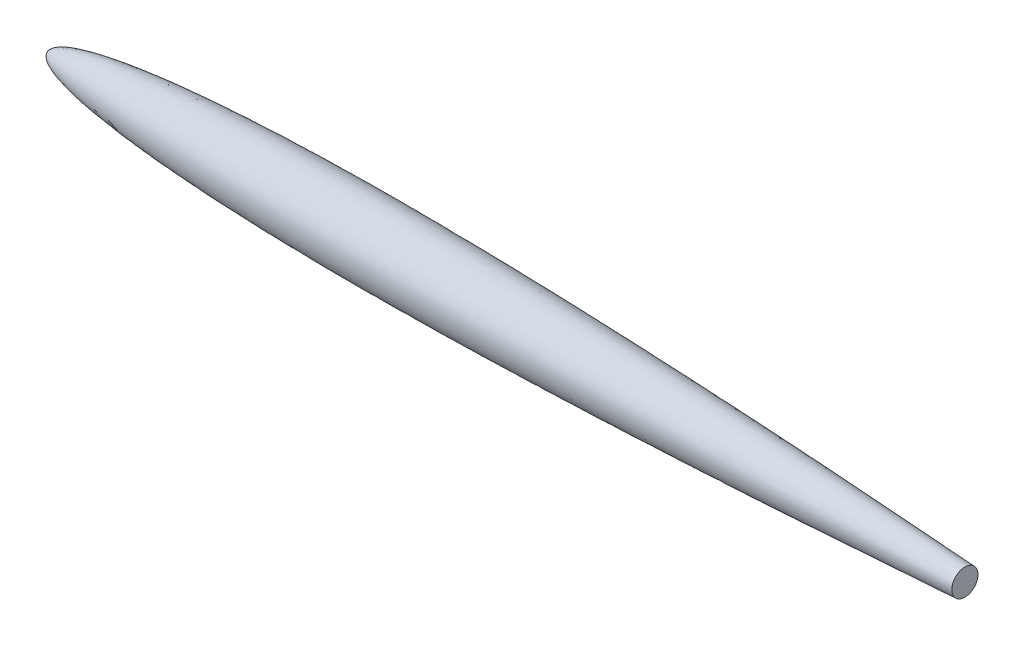
ISO-10303-21;
HEADER;
FILE_DESCRIPTION(('STEP AP214'),'2;1');
FILE_NAME('part.step','',(''),(''),'','','');
FILE_SCHEMA(('AUTOMOTIVE_DESIGN { 1 0 10303 214 1 1 1 1 }'));
ENDSEC;
DATA;
#1=APPLICATION_CONTEXT('core data for automotive mechanical design processes');
#2=APPLICATION_PROTOCOL_DEFINITION('international standard','automotive_design',2000,#1);
#3=PRODUCT_CONTEXT('',#1,'mechanical');
#4=PRODUCT('Part','Part','',(#3));
#5=PRODUCT_RELATED_PRODUCT_CATEGORY('part','',(#4));
#6=PRODUCT_DEFINITION_FORMATION('','',#4);
#7=PRODUCT_DEFINITION_CONTEXT('part definition',#1,'design');
#8=PRODUCT_DEFINITION('design','',#6,#7);
#9=PRODUCT_DEFINITION_SHAPE('','',#8);
#10=(LENGTH_UNIT() NAMED_UNIT(*) SI_UNIT(.MILLI.,.METRE.));
#11=(NAMED_UNIT(*) PLANE_ANGLE_UNIT() SI_UNIT($,.RADIAN.));
#12=(NAMED_UNIT(*) SI_UNIT($,.STERADIAN.) SOLID_ANGLE_UNIT());
#13=UNCERTAINTY_MEASURE_WITH_UNIT(LENGTH_MEASURE(1.E-05),#10,'distance_accuracy_value','');
#14=(GEOMETRIC_REPRESENTATION_CONTEXT(3) GLOBAL_UNCERTAINTY_ASSIGNED_CONTEXT((#13)) GLOBAL_UNIT_ASSIGNED_CONTEXT((#10,
#11,#12)) REPRESENTATION_CONTEXT('',''));
#15=CARTESIAN_POINT('',(0.,0.,0.));
#16=DIRECTION('',(0.,0.,1.));
#17=DIRECTION('',(1.,0.,0.));
#18=AXIS2_PLACEMENT_3D('',#15,#16,#17);
#19=CARTESIAN_POINT('',(10999.9999999114,0.,-6.43708127694486E-09));
#20=CARTESIAN_POINT('',(10993.9727306901,0.,-0.438031797088573));
#21=CARTESIAN_POINT('',(10981.8032504732,0.,-1.32144289600741));
#22=CARTESIAN_POINT('',(10958.8710367509,0.,-2.98352274322804));
#23=CARTESIAN_POINT('',(10934.3368481594,0.,-4.75453023288062));
#24=CARTESIAN_POINT('',(10900.2084233248,0.,-7.21234567680039));
#25=CARTESIAN_POINT('',(10861.0394153717,0.,-10.0201321720221));
#26=CARTESIAN_POINT('',(10814.2581571265,0.,-13.3575019726778));
#27=CARTESIAN_POINT('',(10761.4535922365,0.,-17.1003804288576));
#28=CARTESIAN_POINT('',(10708.2897318897,0.,-20.8462837145694));
#29=CARTESIAN_POINT('',(10655.3329451982,0.,-24.5542716647989));
#30=CARTESIAN_POINT('',(10602.249493916,0.,-28.248814521459));
#31=CARTESIAN_POINT('',(10549.2401673054,0.,-31.9155308261855));
#32=CARTESIAN_POINT('',(10496.1834192708,0.,-35.5634599237538));
#33=CARTESIAN_POINT('',(10443.1529904408,0.,-39.1874437503906));
#34=CARTESIAN_POINT('',(10390.1042798018,0.,-42.7909197834185));
#35=CARTESIAN_POINT('',(10337.0641434928,0.,-46.3721273641647));
#36=CARTESIAN_POINT('',(10284.0167615835,0.,-49.9324023741986));
#37=CARTESIAN_POINT('',(10230.9710465342,0.,-53.4712782182235));
#38=CARTESIAN_POINT('',(10138.1363511123,0.,-59.6277238807782));
#39=CARTESIAN_POINT('',(10032.0349969403,0.,-66.5802700900151));
#40=CARTESIAN_POINT('',(9912.66332687831,0.,-74.2947340481952));
#41=CARTESIAN_POINT('',(9780.0200085779,0.,-82.7330976147289));
#42=CARTESIAN_POINT('',(9673.90020370212,0.,-89.4049347782293));
#43=CARTESIAN_POINT('',(9541.24447252994,0.,-97.6473828977432));
#44=CARTESIAN_POINT('',(9382.04802790126,0.,-107.384401539987));
#45=CARTESIAN_POINT('',(9196.30547929109,0.,-118.523403251807));
#46=CARTESIAN_POINT('',(8984.01062255047,0.,-130.956090450395));
#47=CARTESIAN_POINT('',(8771.69878438221,0.,-143.095088026498));
#48=CARTESIAN_POINT('',(8506.28841889144,0.,-157.9048846195));
#49=CARTESIAN_POINT('',(8187.76401561209,0.,-175.096544248704));
#50=CARTESIAN_POINT('',(7816.10723978569,0.,-194.306117475576));
#51=CARTESIAN_POINT('',(7391.29684687631,0.,-215.071528970679));
#52=CARTESIAN_POINT('',(6966.42760979841,0.,-234.597307497891));
#53=CARTESIAN_POINT('',(6541.49978351588,0.,-252.805736724156));
#54=CARTESIAN_POINT('',(6116.51321361754,0.,-269.590680129271));
#55=CARTESIAN_POINT('',(5691.46768933378,0.,-284.815055747022));
#56=CARTESIAN_POINT('',(5266.36340457883,0.,-298.307410519293));
#57=CARTESIAN_POINT('',(4841.20155804878,0.,-309.857365651042));
#58=CARTESIAN_POINT('',(4415.98520152772,0.,-319.209100207951));
#59=CARTESIAN_POINT('',(3990.72040314142,0.,-326.052290467533));
#60=CARTESIAN_POINT('',(3618.58081240911,0.,-329.513768650375));
#61=CARTESIAN_POINT('',(3299.59192293651,0.,-330.384071895175));
#62=CARTESIAN_POINT('',(3033.76918605138,0.,-329.526860496355));
#63=CARTESIAN_POINT('',(2821.11671644886,0.,-327.806853246903));
#64=CARTESIAN_POINT('',(2608.47621167468,0.,-324.955727137892));
#65=CARTESIAN_POINT('',(2395.85579901899,0.,-320.860371187195));
#66=CARTESIAN_POINT('',(2183.26607259424,0.,-315.387382687774));
#67=CARTESIAN_POINT('',(1970.72108881952,0.,-308.376208713986));
#68=CARTESIAN_POINT('',(1784.82720980626,0.,-300.723903315102));
#69=CARTESIAN_POINT('',(1625.57696457262,0.,-292.926255548081));
#70=CARTESIAN_POINT('',(1492.95401596303,0.,-285.502236935934));
#71=CARTESIAN_POINT('',(1386.93458197183,0.,-278.961621427036));
#72=CARTESIAN_POINT('',(1280.95775603708,0.,-271.761542521152));
#73=CARTESIAN_POINT('',(1175.03259637474,0.,-263.835414150813));
#74=CARTESIAN_POINT('',(1069.17063551745,0.,-255.10283842246));
#75=CARTESIAN_POINT('',(963.38698087677,0.,-245.464526813153));
#76=CARTESIAN_POINT('',(859.684753542944,0.,-234.995657417139));
#77=CARTESIAN_POINT('',(758.084154260968,0.,-223.607887378711));
#78=CARTESIAN_POINT('',(658.612232457384,0.,-211.186619601166));
#79=CARTESIAN_POINT('',(573.469223953823,0.,-199.282575083875));
#80=CARTESIAN_POINT('',(500.651651232557,0.,-187.980684512054));
#81=CARTESIAN_POINT('',(439.719156268776,0.,-177.608967602177));
#82=CARTESIAN_POINT('',(390.608018363905,0.,-168.60304735642));
#83=CARTESIAN_POINT('',(341.243287096751,0.,-158.777969552616));
#84=CARTESIAN_POINT('',(291.6730044071,0.,-147.96396892893));
#85=CARTESIAN_POINT('',(243.07019996589,0.,-136.204737596919));
#86=CARTESIAN_POINT('',(201.291019257043,0.,-124.83380423951));
#87=CARTESIAN_POINT('',(166.299503436915,0.,-114.136034238537));
#88=CARTESIAN_POINT('',(137.455558774662,0.,-104.311070441166));
#89=CARTESIAN_POINT('',(113.95778562596,0.,-95.516746755885));
#90=CARTESIAN_POINT('',(92.789267204734,0.,-86.6434979617395));
#91=CARTESIAN_POINT('',(73.9829790941119,0.,-77.7242846293616));
#92=CARTESIAN_POINT('',(57.0760693623161,0.,-68.6180711546139));
#93=CARTESIAN_POINT('',(43.3840484792573,0.,-60.1943828009551));
#94=CARTESIAN_POINT('',(32.3839476203801,0.,-52.2354073372266));
#95=CARTESIAN_POINT('',(24.0065671735061,0.,-45.0124755369172));
#96=CARTESIAN_POINT('',(18.0050550905463,0.,-39.0824364753431));
#97=CARTESIAN_POINT('',(13.8073677715887,0.,-34.3714872928397));
#98=CARTESIAN_POINT('',(9.99141312001332,0.,-29.3681315340282));
#99=CARTESIAN_POINT('',(6.61089939961276,0.,-23.9643226594275));
#100=CARTESIAN_POINT('',(4.13001991638,0.,-19.1147339577008));
#101=CARTESIAN_POINT('',(2.10965681824584,0.,-13.9384587900824));
#102=CARTESIAN_POINT('',(0.673873379266392,0.,-8.45468671085863));
#103=CARTESIAN_POINT('',(0.122535706790431,0.,-4.24076673461526));
#104=CARTESIAN_POINT('',(0.000193085103623262,0.,-1.41658200533096));
#105=CARTESIAN_POINT('',(0.,0.,0.));
#106=B_SPLINE_CURVE_WITH_KNOTS('',4,(#19,#20,#21,#22,#23,#24,#25,#26,#27,#28,#29,#30,#31,#32,
#33,#34,#35,#36,#37,#38,#39,#40,#41,#42,#43,#44,#45,#46,#47,#48,#49,#50,#51,#52,#53,#54,#55,#56,
#57,#58,#59,#60,#61,#62,#63,#64,#65,#66,#67,#68,#69,#70,#71,#72,#73,#74,#75,#76,#77,#78,#79,#80,
#81,#82,#83,#84,#85,#86,#87,#88,#89,#90,#91,#92,#93,#94,#95,#96,#97,#98,#99,#100,#101,#102,#103,
#104,#105),.UNSPECIFIED.,.F.,.F.,(5,1,1,1,1,1,1,1,1,1,1,1,1,1,1,1,1,1,1,1,1,1,1,1,1,1,1,1,1,1,1,
1,1,1,1,1,1,1,1,1,1,1,1,1,1,1,1,1,1,1,1,1,1,1,1,1,1,1,1,1,1,1,1,1,1,1,1,1,1,1,1,1,1,1,1,1,1,1,1,
1,1,1,1,5),(0.,0.00218399049332629,0.00436798098665259,0.00655197147997888,0.00873596197330506,
0.0131039429599575,0.0174719239466101,0.0218399049332627,0.0262078859199152,0.0305758669065677,
0.0349438478932202,0.0393118288798728,0.0436798098665253,0.0480477908531778,0.0524157718398304,
0.056783752826483,0.0611517338131355,0.0655197147997881,0.0698876957864406,0.0873596195907531,
0.0960955814929094,0.104831543395066,0.113567505297222,0.122303467199378,0.139775391003691,
0.157247314726167,0.174719238448643,0.192191162171119,0.209663085893595,0.244606933696528,
0.279550781499461,0.314494629065929,0.349438476632398,0.384382324291439,0.419326171950479,
0.454270019603899,0.489213867257318,0.524157714808659,0.55910156236,0.59404540992135,
0.628989257482701,0.64646118120193,0.663933104921159,0.681405028640388,0.698876952359617,
0.7163488755104,0.733820798661182,0.751292721811965,0.768764644962747,0.777491660977801,
0.786218676992855,0.794945693007909,0.803672709022963,0.812399725038017,0.821126741053071,
0.829853757068125,0.83858077308318,0.846652825380427,0.854724877677674,0.862796929974921,
0.866832956123545,0.870868982272168,0.875037162263929,0.87920534225569,0.883373522247451,
0.887541702239212,0.891468997897097,0.893432645726039,0.895396293554981,0.897554586719237,
0.899712879883493,0.900973305631297,0.902233731379101,0.903863140324877,0.904992308472623,
0.905428762244265,0.905865216015906,0.906634793353248,0.907064106863914,0.90749342037458,
0.907957873985982,0.908422327597384,0.908886781208786,0.909351234820188),.UNSPECIFIED.);
#107=CARTESIAN_POINT('',(0.,0.,0.));
#108=DIRECTION('',(-1.,0.,0.));
#109=AXIS1_PLACEMENT('',#107,#108);
#110=SURFACE_OF_REVOLUTION('',#106,#109);
#111=CARTESIAN_POINT('',(0.,0.,0.));
#112=VERTEX_POINT('',#111);
#113=VERTEX_LOOP('',#112);
#114=FACE_BOUND('',#113,.T.);
#115=CARTESIAN_POINT('',(9020.,0.,0.));
#116=DIRECTION('',(-1.,0.,0.));
#117=DIRECTION('',(0.,0.,1.));
#118=AXIS2_PLACEMENT_3D('',#115,#116,#117);
#119=CIRCLE('',#118,128.807754302869);
#120=CARTESIAN_POINT('',(9020.,0.,128.807754302869));
#121=VERTEX_POINT('',#120);
#122=EDGE_CURVE('E11',#121,#121,#119,.F.);
#123=ORIENTED_EDGE('',*,*,#122,.F.);
#124=EDGE_LOOP('',(#123));
#125=FACE_BOUND('',#124,.T.);
#126=ADVANCED_FACE('F36',(#114,#125),#110,.T.);
#127=CARTESIAN_POINT('',(9020.,0.,0.));
#128=DIRECTION('',(1.,0.,0.));
#129=DIRECTION('',(0.,0.,-1.));
#130=AXIS2_PLACEMENT_3D('',#127,#128,#129);
#131=PLANE('',#130);
#132=ORIENTED_EDGE('',*,*,#122,.T.);
#133=EDGE_LOOP('',(#132));
#134=FACE_BOUND('',#133,.T.);
#135=ADVANCED_FACE('F46',(#134),#131,.T.);
#136=CLOSED_SHELL('',(#126,#135));
#137=MANIFOLD_SOLID_BREP('B2',#136);
#138=ADVANCED_BREP_SHAPE_REPRESENTATION('',(#18,#137),#14);
#139=SHAPE_DEFINITION_REPRESENTATION(#9,#138);
ENDSEC;
END-ISO-10303-21;
